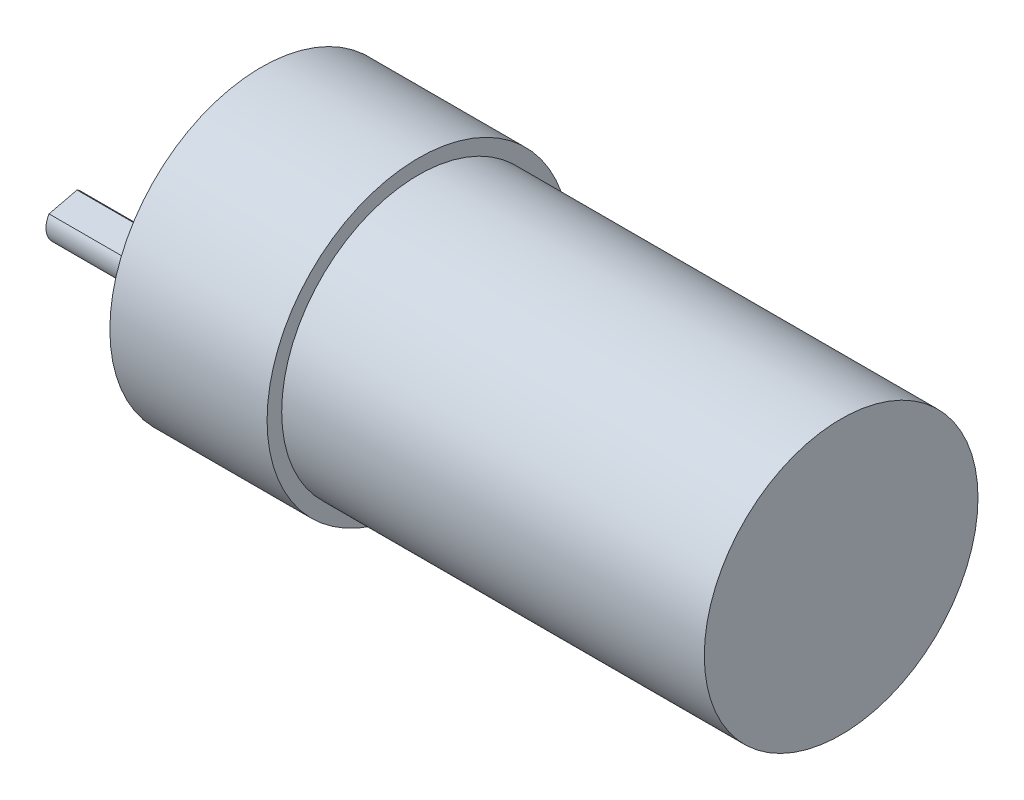
ISO-10303-21;
HEADER;
FILE_DESCRIPTION(('STEP AP214'),'2;1');
FILE_NAME('part.step','',(''),(''),'','','');
FILE_SCHEMA(('AUTOMOTIVE_DESIGN { 1 0 10303 214 1 1 1 1 }'));
ENDSEC;
DATA;
#1=APPLICATION_CONTEXT('core data for automotive mechanical design processes');
#2=APPLICATION_PROTOCOL_DEFINITION('international standard','automotive_design',2000,#1);
#3=PRODUCT_CONTEXT('',#1,'mechanical');
#4=PRODUCT('Part','Part','',(#3));
#5=PRODUCT_RELATED_PRODUCT_CATEGORY('part','',(#4));
#6=PRODUCT_DEFINITION_FORMATION('','',#4);
#7=PRODUCT_DEFINITION_CONTEXT('part definition',#1,'design');
#8=PRODUCT_DEFINITION('design','',#6,#7);
#9=PRODUCT_DEFINITION_SHAPE('','',#8);
#10=(LENGTH_UNIT() NAMED_UNIT(*) SI_UNIT(.MILLI.,.METRE.));
#11=(NAMED_UNIT(*) PLANE_ANGLE_UNIT() SI_UNIT($,.RADIAN.));
#12=(NAMED_UNIT(*) SI_UNIT($,.STERADIAN.) SOLID_ANGLE_UNIT());
#13=UNCERTAINTY_MEASURE_WITH_UNIT(LENGTH_MEASURE(1.E-05),#10,'distance_accuracy_value','');
#14=(GEOMETRIC_REPRESENTATION_CONTEXT(3) GLOBAL_UNCERTAINTY_ASSIGNED_CONTEXT((#13)) GLOBAL_UNIT_ASSIGNED_CONTEXT((#10,
#11,#12)) REPRESENTATION_CONTEXT('',''));
#15=CARTESIAN_POINT('',(0.,0.,0.));
#16=DIRECTION('',(0.,0.,1.));
#17=DIRECTION('',(1.,0.,0.));
#18=AXIS2_PLACEMENT_3D('',#15,#16,#17);
#19=CARTESIAN_POINT('',(-40.8432,-8.71855,0.));
#20=DIRECTION('',(1.,0.,0.));
#21=DIRECTION('',(0.,0.,-1.));
#22=AXIS2_PLACEMENT_3D('',#19,#20,#21);
#23=CYLINDRICAL_SURFACE('',#22,2.3749);
#24=CARTESIAN_POINT('',(-18.2372,-8.71855,0.));
#25=DIRECTION('',(-1.,0.,0.));
#26=DIRECTION('',(0.,0.,1.));
#27=AXIS2_PLACEMENT_3D('',#24,#25,#26);
#28=CIRCLE('',#27,2.3749);
#29=CARTESIAN_POINT('',(-18.2372,-8.71855,2.3749));
#30=VERTEX_POINT('',#29);
#31=EDGE_CURVE('E87',#30,#30,#28,.T.);
#32=ORIENTED_EDGE('',*,*,#31,.T.);
#33=EDGE_LOOP('',(#32));
#34=FACE_BOUND('',#33,.T.);
#35=DIRECTION('',(1.,0.,0.));
#36=VECTOR('',#35,1.);
#37=CARTESIAN_POINT('',(-40.8432,-6.68747817064265,-1.23081161596361));
#38=LINE('',#37,#36);
#39=CARTESIAN_POINT('',(-25.8572,-6.68747817064265,-1.23081161596361));
#40=VERTEX_POINT('',#39);
#41=CARTESIAN_POINT('',(-40.8432,-6.68747817064265,-1.23081161596361));
#42=VERTEX_POINT('',#41);
#43=EDGE_CURVE('E48',#40,#42,#38,.F.);
#44=ORIENTED_EDGE('',*,*,#43,.F.);
#45=CARTESIAN_POINT('',(-25.8572,-8.71855,0.));
#46=DIRECTION('',(1.,0.,0.));
#47=DIRECTION('',(0.,0.,-1.));
#48=AXIS2_PLACEMENT_3D('',#45,#46,#47);
#49=CIRCLE('',#48,2.3749);
#50=CARTESIAN_POINT('',(-25.8572,-7.46406700754952,2.01653723785416));
#51=VERTEX_POINT('',#50);
#52=EDGE_CURVE('E11',#40,#51,#49,.T.);
#53=ORIENTED_EDGE('',*,*,#52,.T.);
#54=DIRECTION('',(1.,0.,0.));
#55=VECTOR('',#54,1.);
#56=CARTESIAN_POINT('',(-40.8432,-7.46406700754952,2.01653723785416));
#57=LINE('',#56,#55);
#58=CARTESIAN_POINT('',(-40.8432,-7.46406700754952,2.01653723785416));
#59=VERTEX_POINT('',#58);
#60=EDGE_CURVE('E57',#59,#51,#57,.T.);
#61=ORIENTED_EDGE('',*,*,#60,.F.);
#62=CARTESIAN_POINT('',(-40.8432,-8.71855,0.));
#63=DIRECTION('',(-1.,0.,0.));
#64=DIRECTION('',(0.,0.,1.));
#65=AXIS2_PLACEMENT_3D('',#62,#63,#64);
#66=CIRCLE('',#65,2.3749);
#67=EDGE_CURVE('E69',#42,#59,#66,.T.);
#68=ORIENTED_EDGE('',*,*,#67,.F.);
#69=EDGE_LOOP('',(#44,#53,#61,#68));
#70=FACE_BOUND('',#69,.T.);
#71=ADVANCED_FACE('F33',(#34,#70),#23,.T.);
#72=CARTESIAN_POINT('',(-40.8432,-8.71855,0.));
#73=DIRECTION('',(-1.,0.,0.));
#74=DIRECTION('',(0.,0.,1.));
#75=AXIS2_PLACEMENT_3D('',#72,#73,#74);
#76=PLANE('',#75);
#77=ORIENTED_EDGE('',*,*,#67,.T.);
#78=DIRECTION('',(0.,0.232587064676617,-0.972575579245703));
#79=VECTOR('',#78,1.);
#80=CARTESIAN_POINT('',(-40.8432,-7.07577258909608,0.392862810945275));
#81=LINE('',#80,#79);
#82=EDGE_CURVE('E41',#59,#42,#81,.T.);
#83=ORIENTED_EDGE('',*,*,#82,.T.);
#84=EDGE_LOOP('',(#77,#83));
#85=FACE_BOUND('',#84,.T.);
#86=ADVANCED_FACE('F105',(#85),#76,.T.);
#87=CARTESIAN_POINT('',(-18.2372,0.,0.));
#88=DIRECTION('',(-1.,0.,0.));
#89=DIRECTION('',(0.,0.,1.));
#90=AXIS2_PLACEMENT_3D('',#87,#88,#89);
#91=PLANE('',#90);
#92=CARTESIAN_POINT('',(-18.2372,-8.71855,-10.2108));
#93=DIRECTION('',(-1.,0.,0.));
#94=DIRECTION('',(0.,0.,1.));
#95=AXIS2_PLACEMENT_3D('',#92,#93,#94);
#96=CIRCLE('',#95,1.27);
#97=CARTESIAN_POINT('',(-18.2372,-8.71855,-8.9408));
#98=VERTEX_POINT('',#97);
#99=EDGE_CURVE('E64',#98,#98,#96,.T.);
#100=ORIENTED_EDGE('',*,*,#99,.F.);
#101=EDGE_LOOP('',(#100));
#102=FACE_BOUND('',#101,.T.);
#103=CARTESIAN_POINT('',(-18.2372,-8.71855,10.2108));
#104=DIRECTION('',(-1.,0.,0.));
#105=DIRECTION('',(0.,0.,1.));
#106=AXIS2_PLACEMENT_3D('',#103,#104,#105);
#107=CIRCLE('',#106,1.27);
#108=CARTESIAN_POINT('',(-18.2372,-8.71855,11.4808));
#109=VERTEX_POINT('',#108);
#110=EDGE_CURVE('E75',#109,#109,#107,.T.);
#111=ORIENTED_EDGE('',*,*,#110,.F.);
#112=EDGE_LOOP('',(#111));
#113=FACE_BOUND('',#112,.T.);
#114=CARTESIAN_POINT('',(-18.2372,13.45565,0.));
#115=DIRECTION('',(-1.,0.,0.));
#116=DIRECTION('',(0.,0.,1.));
#117=AXIS2_PLACEMENT_3D('',#114,#115,#116);
#118=CIRCLE('',#117,1.27);
#119=CARTESIAN_POINT('',(-18.2372,13.45565,1.27));
#120=VERTEX_POINT('',#119);
#121=EDGE_CURVE('E81',#120,#120,#118,.T.);
#122=ORIENTED_EDGE('',*,*,#121,.F.);
#123=EDGE_LOOP('',(#122));
#124=FACE_BOUND('',#123,.T.);
#125=CARTESIAN_POINT('',(-18.2372,0.,0.));
#126=DIRECTION('',(-1.,0.,0.));
#127=DIRECTION('',(0.,0.,1.));
#128=AXIS2_PLACEMENT_3D('',#125,#126,#127);
#129=CIRCLE('',#128,17.56918);
#130=CARTESIAN_POINT('',(-18.2372,0.,17.56918));
#131=VERTEX_POINT('',#130);
#132=EDGE_CURVE('E94',#131,#131,#129,.T.);
#133=ORIENTED_EDGE('',*,*,#132,.T.);
#134=EDGE_LOOP('',(#133));
#135=FACE_BOUND('',#134,.T.);
#136=ORIENTED_EDGE('',*,*,#31,.F.);
#137=EDGE_LOOP('',(#136));
#138=FACE_BOUND('',#137,.T.);
#139=ADVANCED_FACE('F107',(#102,#113,#124,#135,#138),#91,.T.);
#140=CARTESIAN_POINT('',(49.022,0.,0.));
#141=DIRECTION('',(-1.,0.,0.));
#142=DIRECTION('',(0.,0.,1.));
#143=AXIS2_PLACEMENT_3D('',#140,#141,#142);
#144=CYLINDRICAL_SURFACE('',#143,15.875);
#145=CARTESIAN_POINT('',(49.022,0.,0.));
#146=DIRECTION('',(1.,0.,0.));
#147=DIRECTION('',(0.,0.,-1.));
#148=AXIS2_PLACEMENT_3D('',#145,#146,#147);
#149=CIRCLE('',#148,15.875);
#150=CARTESIAN_POINT('',(49.022,0.,-15.875));
#151=VERTEX_POINT('',#150);
#152=EDGE_CURVE('E102',#151,#151,#149,.T.);
#153=ORIENTED_EDGE('',*,*,#152,.F.);
#154=EDGE_LOOP('',(#153));
#155=FACE_BOUND('',#154,.T.);
#156=CARTESIAN_POINT('',(0.,0.,0.));
#157=DIRECTION('',(-1.,0.,0.));
#158=DIRECTION('',(0.,0.,1.));
#159=AXIS2_PLACEMENT_3D('',#156,#157,#158);
#160=CIRCLE('',#159,15.875);
#161=CARTESIAN_POINT('',(0.,0.,15.875));
#162=VERTEX_POINT('',#161);
#163=EDGE_CURVE('E97',#162,#162,#160,.T.);
#164=ORIENTED_EDGE('',*,*,#163,.F.);
#165=EDGE_LOOP('',(#164));
#166=FACE_BOUND('',#165,.T.);
#167=ADVANCED_FACE('F35',(#155,#166),#144,.T.);
#168=CARTESIAN_POINT('',(49.022,0.,0.));
#169=DIRECTION('',(1.,0.,0.));
#170=DIRECTION('',(0.,0.,-1.));
#171=AXIS2_PLACEMENT_3D('',#168,#169,#170);
#172=PLANE('',#171);
#173=ORIENTED_EDGE('',*,*,#152,.T.);
#174=EDGE_LOOP('',(#173));
#175=FACE_BOUND('',#174,.T.);
#176=ADVANCED_FACE('F125',(#175),#172,.T.);
#177=CARTESIAN_POINT('',(0.,0.,0.));
#178=DIRECTION('',(-1.,0.,0.));
#179=DIRECTION('',(0.,0.,1.));
#180=AXIS2_PLACEMENT_3D('',#177,#178,#179);
#181=PLANE('',#180);
#182=CARTESIAN_POINT('',(0.,0.,0.));
#183=DIRECTION('',(-1.,0.,0.));
#184=DIRECTION('',(0.,0.,1.));
#185=AXIS2_PLACEMENT_3D('',#182,#183,#184);
#186=CIRCLE('',#185,17.56918);
#187=CARTESIAN_POINT('',(0.,0.,17.56918));
#188=VERTEX_POINT('',#187);
#189=EDGE_CURVE('E91',#188,#188,#186,.T.);
#190=ORIENTED_EDGE('',*,*,#189,.F.);
#191=EDGE_LOOP('',(#190));
#192=FACE_BOUND('',#191,.T.);
#193=ORIENTED_EDGE('',*,*,#163,.T.);
#194=EDGE_LOOP('',(#193));
#195=FACE_BOUND('',#194,.T.);
#196=ADVANCED_FACE('F121',(#192,#195),#181,.F.);
#197=CARTESIAN_POINT('',(-18.2372,0.,0.));
#198=DIRECTION('',(1.,0.,0.));
#199=DIRECTION('',(0.,0.,-1.));
#200=AXIS2_PLACEMENT_3D('',#197,#198,#199);
#201=CYLINDRICAL_SURFACE('',#200,17.56918);
#202=ORIENTED_EDGE('',*,*,#132,.F.);
#203=EDGE_LOOP('',(#202));
#204=FACE_BOUND('',#203,.T.);
#205=ORIENTED_EDGE('',*,*,#189,.T.);
#206=EDGE_LOOP('',(#205));
#207=FACE_BOUND('',#206,.T.);
#208=ADVANCED_FACE('F124',(#204,#207),#201,.T.);
#209=CARTESIAN_POINT('',(-8.2372,13.45565,0.));
#210=DIRECTION('',(-1.,0.,0.));
#211=DIRECTION('',(0.,0.,1.));
#212=AXIS2_PLACEMENT_3D('',#209,#210,#211);
#213=CYLINDRICAL_SURFACE('',#212,1.27);
#214=CARTESIAN_POINT('',(-8.2372,13.45565,0.));
#215=DIRECTION('',(-1.,0.,0.));
#216=DIRECTION('',(0.,0.,1.));
#217=AXIS2_PLACEMENT_3D('',#214,#215,#216);
#218=CIRCLE('',#217,1.27);
#219=CARTESIAN_POINT('',(-8.2372,13.45565,1.27));
#220=VERTEX_POINT('',#219);
#221=EDGE_CURVE('E84',#220,#220,#218,.T.);
#222=ORIENTED_EDGE('',*,*,#221,.F.);
#223=EDGE_LOOP('',(#222));
#224=FACE_BOUND('',#223,.T.);
#225=ORIENTED_EDGE('',*,*,#121,.T.);
#226=EDGE_LOOP('',(#225));
#227=FACE_BOUND('',#226,.T.);
#228=ADVANCED_FACE('F118',(#224,#227),#213,.F.);
#229=CARTESIAN_POINT('',(-8.2372,13.45565,0.));
#230=DIRECTION('',(-1.,0.,0.));
#231=DIRECTION('',(0.,0.,1.));
#232=AXIS2_PLACEMENT_3D('',#229,#230,#231);
#233=PLANE('',#232);
#234=ORIENTED_EDGE('',*,*,#221,.T.);
#235=EDGE_LOOP('',(#234));
#236=FACE_BOUND('',#235,.T.);
#237=ADVANCED_FACE('F153',(#236),#233,.T.);
#238=CARTESIAN_POINT('',(-8.2372,-8.71855,10.2108));
#239=DIRECTION('',(-1.,0.,0.));
#240=DIRECTION('',(0.,0.,1.));
#241=AXIS2_PLACEMENT_3D('',#238,#239,#240);
#242=CYLINDRICAL_SURFACE('',#241,1.27);
#243=CARTESIAN_POINT('',(-8.2372,-8.71855,10.2108));
#244=DIRECTION('',(-1.,0.,0.));
#245=DIRECTION('',(0.,0.,1.));
#246=AXIS2_PLACEMENT_3D('',#243,#244,#245);
#247=CIRCLE('',#246,1.27);
#248=CARTESIAN_POINT('',(-8.2372,-8.71855,11.4808));
#249=VERTEX_POINT('',#248);
#250=EDGE_CURVE('E78',#249,#249,#247,.T.);
#251=ORIENTED_EDGE('',*,*,#250,.F.);
#252=EDGE_LOOP('',(#251));
#253=FACE_BOUND('',#252,.T.);
#254=ORIENTED_EDGE('',*,*,#110,.T.);
#255=EDGE_LOOP('',(#254));
#256=FACE_BOUND('',#255,.T.);
#257=ADVANCED_FACE('F158',(#253,#256),#242,.F.);
#258=CARTESIAN_POINT('',(-8.2372,-8.71855,10.2108));
#259=DIRECTION('',(-1.,0.,0.));
#260=DIRECTION('',(0.,0.,1.));
#261=AXIS2_PLACEMENT_3D('',#258,#259,#260);
#262=PLANE('',#261);
#263=ORIENTED_EDGE('',*,*,#250,.T.);
#264=EDGE_LOOP('',(#263));
#265=FACE_BOUND('',#264,.T.);
#266=ADVANCED_FACE('F163',(#265),#262,.T.);
#267=CARTESIAN_POINT('',(-8.2372,-8.71855,-10.2108));
#268=DIRECTION('',(-1.,0.,0.));
#269=DIRECTION('',(0.,0.,1.));
#270=AXIS2_PLACEMENT_3D('',#267,#268,#269);
#271=CYLINDRICAL_SURFACE('',#270,1.27);
#272=CARTESIAN_POINT('',(-8.2372,-8.71855,-10.2108));
#273=DIRECTION('',(-1.,0.,0.));
#274=DIRECTION('',(0.,0.,1.));
#275=AXIS2_PLACEMENT_3D('',#272,#273,#274);
#276=CIRCLE('',#275,1.27);
#277=CARTESIAN_POINT('',(-8.2372,-8.71855,-8.9408));
#278=VERTEX_POINT('',#277);
#279=EDGE_CURVE('E72',#278,#278,#276,.T.);
#280=ORIENTED_EDGE('',*,*,#279,.F.);
#281=EDGE_LOOP('',(#280));
#282=FACE_BOUND('',#281,.T.);
#283=ORIENTED_EDGE('',*,*,#99,.T.);
#284=EDGE_LOOP('',(#283));
#285=FACE_BOUND('',#284,.T.);
#286=ADVANCED_FACE('F173',(#282,#285),#271,.F.);
#287=CARTESIAN_POINT('',(-8.2372,-8.71855,-10.2108));
#288=DIRECTION('',(-1.,0.,0.));
#289=DIRECTION('',(0.,0.,1.));
#290=AXIS2_PLACEMENT_3D('',#287,#288,#289);
#291=PLANE('',#290);
#292=ORIENTED_EDGE('',*,*,#279,.T.);
#293=EDGE_LOOP('',(#292));
#294=FACE_BOUND('',#293,.T.);
#295=ADVANCED_FACE('F183',(#294),#291,.T.);
#296=CARTESIAN_POINT('',(-25.8572,-8.21958385216718,5.17577239912827));
#297=DIRECTION('',(1.,0.,0.));
#298=DIRECTION('',(0.,0.,-1.));
#299=AXIS2_PLACEMENT_3D('',#296,#297,#298);
#300=PLANE('',#299);
#301=DIRECTION('',(0.,0.232587064676617,-0.972575579245703));
#302=VECTOR('',#301,1.);
#303=CARTESIAN_POINT('',(-25.8572,-8.21958385216718,5.17577239912827));
#304=LINE('',#303,#302);
#305=EDGE_CURVE('E60',#51,#40,#304,.T.);
#306=ORIENTED_EDGE('',*,*,#305,.F.);
#307=ORIENTED_EDGE('',*,*,#52,.F.);
#308=EDGE_LOOP('',(#306,#307));
#309=FACE_BOUND('',#308,.T.);
#310=ADVANCED_FACE('F67',(#309),#300,.F.);
#311=CARTESIAN_POINT('',(-25.8572,-5.65789785603313,-5.5360582222337));
#312=DIRECTION('',(0.,0.972575579245703,0.232587064676617));
#313=DIRECTION('',(0.,-0.232587064676617,0.972575579245703));
#314=AXIS2_PLACEMENT_3D('',#311,#312,#313);
#315=PLANE('',#314);
#316=ORIENTED_EDGE('',*,*,#60,.T.);
#317=ORIENTED_EDGE('',*,*,#305,.T.);
#318=ORIENTED_EDGE('',*,*,#43,.T.);
#319=ORIENTED_EDGE('',*,*,#82,.F.);
#320=EDGE_LOOP('',(#316,#317,#318,#319));
#321=FACE_BOUND('',#320,.T.);
#322=ADVANCED_FACE('F59',(#321),#315,.T.);
#323=CLOSED_SHELL('',(#71,#86,#139,#167,#176,#196,#208,#228,#237,#257,#266,#286,#295,#310,#322));
#324=MANIFOLD_SOLID_BREP('B2',#323);
#325=ADVANCED_BREP_SHAPE_REPRESENTATION('',(#18,#324),#14);
#326=SHAPE_DEFINITION_REPRESENTATION(#9,#325);
ENDSEC;
END-ISO-10303-21;
